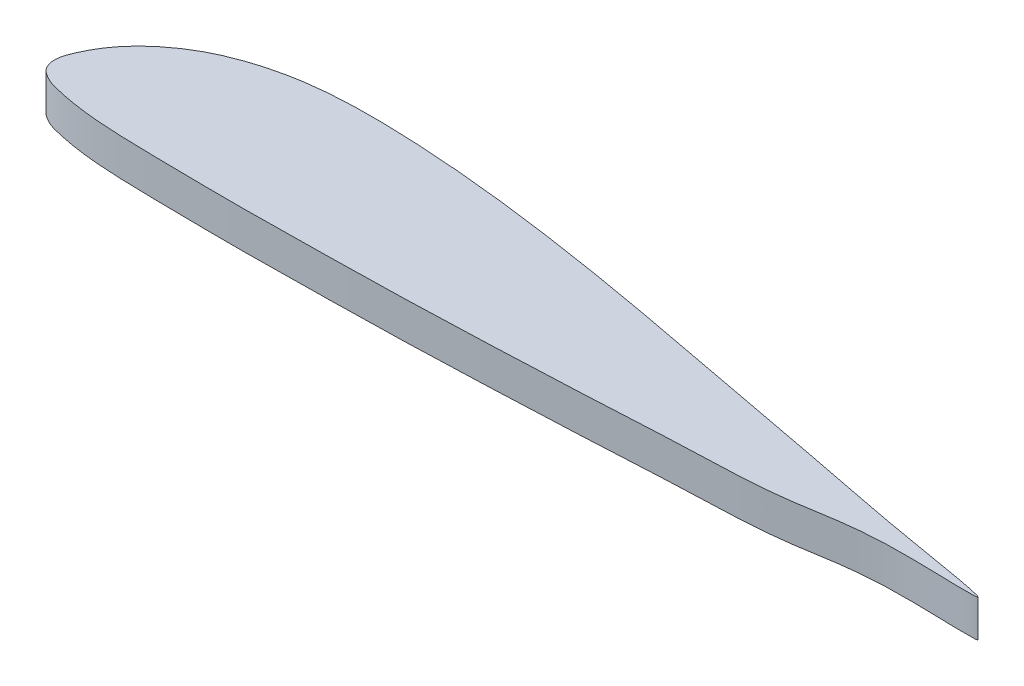
ISO-10303-21;
HEADER;
FILE_DESCRIPTION(('STEP AP214'),'2;1');
FILE_NAME('part.step','',(''),(''),'','','');
FILE_SCHEMA(('AUTOMOTIVE_DESIGN { 1 0 10303 214 1 1 1 1 }'));
ENDSEC;
DATA;
#1=APPLICATION_CONTEXT('core data for automotive mechanical design processes');
#2=APPLICATION_PROTOCOL_DEFINITION('international standard','automotive_design',2000,#1);
#3=PRODUCT_CONTEXT('',#1,'mechanical');
#4=PRODUCT('Part','Part','',(#3));
#5=PRODUCT_RELATED_PRODUCT_CATEGORY('part','',(#4));
#6=PRODUCT_DEFINITION_FORMATION('','',#4);
#7=PRODUCT_DEFINITION_CONTEXT('part definition',#1,'design');
#8=PRODUCT_DEFINITION('design','',#6,#7);
#9=PRODUCT_DEFINITION_SHAPE('','',#8);
#10=(LENGTH_UNIT() NAMED_UNIT(*) SI_UNIT(.MILLI.,.METRE.));
#11=(NAMED_UNIT(*) PLANE_ANGLE_UNIT() SI_UNIT($,.RADIAN.));
#12=(NAMED_UNIT(*) SI_UNIT($,.STERADIAN.) SOLID_ANGLE_UNIT());
#13=UNCERTAINTY_MEASURE_WITH_UNIT(LENGTH_MEASURE(1.E-05),#10,'distance_accuracy_value','');
#14=(GEOMETRIC_REPRESENTATION_CONTEXT(3) GLOBAL_UNCERTAINTY_ASSIGNED_CONTEXT((#13)) GLOBAL_UNIT_ASSIGNED_CONTEXT((#10,
#11,#12)) REPRESENTATION_CONTEXT('',''));
#15=CARTESIAN_POINT('',(0.,0.,0.));
#16=DIRECTION('',(0.,0.,1.));
#17=DIRECTION('',(1.,0.,0.));
#18=AXIS2_PLACEMENT_3D('',#15,#16,#17);
#19=CARTESIAN_POINT('',(100.,4.,0.));
#20=CARTESIAN_POINT('',(100.062832480907,4.,-0.251035490916848));
#21=CARTESIAN_POINT('',(88.4237829738261,4.,-2.0771715448077));
#22=CARTESIAN_POINT('',(80.4225108702479,4.,-3.75334635679778));
#23=CARTESIAN_POINT('',(69.8861735451824,4.,-5.70944302800117));
#24=CARTESIAN_POINT('',(60.0386647343152,4.,-7.60775001107157));
#25=CARTESIAN_POINT('',(50.0167380307963,4.,-9.4487948912524));
#26=CARTESIAN_POINT('',(40.0326469934087,4.,-10.9740248038323));
#27=CARTESIAN_POINT('',(31.6814423764122,4.,-11.8576172335413));
#28=CARTESIAN_POINT('',(25.0037329246573,4.,-12.2188022333978));
#29=CARTESIAN_POINT('',(19.9912873424954,4.,-12.2559016705021));
#30=CARTESIAN_POINT('',(14.9320267444677,4.,-11.8315252621144));
#31=CARTESIAN_POINT('',(10.5526989070335,4.,-10.71719481114));
#32=CARTESIAN_POINT('',(7.22601465795583,4.,-9.26426829298485));
#33=CARTESIAN_POINT('',(4.89414281103323,4.,-7.74090036610056));
#34=CARTESIAN_POINT('',(3.22731717546887,4.,-6.30206869587759));
#35=CARTESIAN_POINT('',(1.90757730482551,4.,-4.78457492361257));
#36=CARTESIAN_POINT('',(1.09051334858228,4.,-3.51760297719199));
#37=CARTESIAN_POINT('',(0.311104340416445,4.,-1.94974356982834));
#38=CARTESIAN_POINT('',(-0.274693212782225,4.,-0.387957211097651));
#39=CARTESIAN_POINT('',(0.32241480183204,4.,0.985991259469998));
#40=CARTESIAN_POINT('',(1.12808598583183,4.,1.55327589883329));
#41=CARTESIAN_POINT('',(1.96074307258525,4.,1.98040220262235));
#42=CARTESIAN_POINT('',(3.32507579893781,4.,2.31439891849714));
#43=CARTESIAN_POINT('',(4.98847485858098,4.,2.6515194414197));
#44=CARTESIAN_POINT('',(7.32589348227786,4.,2.96082977289899));
#45=CARTESIAN_POINT('',(10.6627022753876,4.,3.18329815717093));
#46=CARTESIAN_POINT('',(14.9997431695759,4.,3.25230992258939));
#47=CARTESIAN_POINT('',(19.9997023833687,4.,3.31799073600512));
#48=CARTESIAN_POINT('',(25.0003041833152,4.,3.33571491492282));
#49=CARTESIAN_POINT('',(31.6666118269952,4.,3.23361568674636));
#50=CARTESIAN_POINT('',(40.0045418118961,4.,3.11880279253148));
#51=CARTESIAN_POINT('',(49.9937027305764,4.,2.74791710747211));
#52=CARTESIAN_POINT('',(60.032071472342,4.,2.32907933399613));
#53=CARTESIAN_POINT('',(69.8872598450056,4.,1.73529353143155));
#54=CARTESIAN_POINT('',(80.4501817556825,4.,1.52889578989182));
#55=CARTESIAN_POINT('',(88.4174601450651,4.,-0.540970313366487));
#56=CARTESIAN_POINT('',(99.9382718343949,4.,0.246623404524663));
#57=CARTESIAN_POINT('',(100.,4.,0.));
#58=B_SPLINE_CURVE_WITH_KNOTS('',3,(#19,#20,#21,#22,#23,#24,#25,#26,#27,#28,#29,#30,#31,#32,#33,
#34,#35,#36,#37,#38,#39,#40,#41,#42,#43,#44,#45,#46,#47,#48,#49,#50,#51,#52,#53,#54,#55,#56,
#57),.UNSPECIFIED.,.T.,.F.,(4,1,1,1,1,1,1,1,1,1,1,1,1,1,1,1,1,1,1,1,1,1,1,1,1,1,1,1,1,1,1,1,1,1,
1,1,4),(0.,0.0490408656764944,0.0980817313529888,0.147122597029483,0.196163462705978,
0.245116685545263,0.293834629256661,0.342263553193416,0.366385572960314,0.390475045746911,
0.414675268241992,0.439565651155836,0.455415352681607,0.466907823883372,0.479711554297043,
0.48709032929319,0.495936907344408,0.501323477213704,0.512663454203477,0.518310059511212,
0.521365151754157,0.526751721623454,0.531754914327112,0.541581529671993,0.551304728452871,
0.565797224363326,0.589894838016151,0.613986045182352,0.638075566147846,0.662166773314048,
0.710353523244322,0.758560308204797,0.806785868446715,0.85502500010905,0.903284914630982,
0.951821054426205,1.),.UNSPECIFIED.);
#59=DIRECTION('',(0.,-1.,0.));
#60=VECTOR('',#59,1.);
#61=SURFACE_OF_LINEAR_EXTRUSION('',#58,#60);
#62=CARTESIAN_POINT('',(100.,4.,0.));
#63=VERTEX_POINT('',#62);
#64=EDGE_CURVE('E10',#63,#63,#58,.T.);
#65=ORIENTED_EDGE('',*,*,#64,.F.);
#66=EDGE_LOOP('',(#65));
#67=FACE_BOUND('',#66,.T.);
#68=CARTESIAN_POINT('',(100.,0.,0.));
#69=CARTESIAN_POINT('',(100.062832480907,0.,-0.251035490916848));
#70=CARTESIAN_POINT('',(88.4237829738261,0.,-2.0771715448077));
#71=CARTESIAN_POINT('',(80.4225108702479,0.,-3.75334635679778));
#72=CARTESIAN_POINT('',(69.8861735451824,0.,-5.70944302800117));
#73=CARTESIAN_POINT('',(60.0386647343152,0.,-7.60775001107157));
#74=CARTESIAN_POINT('',(50.0167380307963,0.,-9.4487948912524));
#75=CARTESIAN_POINT('',(40.0326469934087,0.,-10.9740248038323));
#76=CARTESIAN_POINT('',(31.6814423764122,0.,-11.8576172335413));
#77=CARTESIAN_POINT('',(25.0037329246573,0.,-12.2188022333978));
#78=CARTESIAN_POINT('',(19.9912873424954,0.,-12.2559016705021));
#79=CARTESIAN_POINT('',(14.9320267444677,0.,-11.8315252621144));
#80=CARTESIAN_POINT('',(10.5526989070335,0.,-10.71719481114));
#81=CARTESIAN_POINT('',(7.22601465795583,0.,-9.26426829298485));
#82=CARTESIAN_POINT('',(4.89414281103323,0.,-7.74090036610056));
#83=CARTESIAN_POINT('',(3.22731717546887,0.,-6.30206869587759));
#84=CARTESIAN_POINT('',(1.90757730482551,0.,-4.78457492361257));
#85=CARTESIAN_POINT('',(1.09051334858228,0.,-3.51760297719199));
#86=CARTESIAN_POINT('',(0.311104340416445,0.,-1.94974356982834));
#87=CARTESIAN_POINT('',(-0.274693212782225,0.,-0.387957211097651));
#88=CARTESIAN_POINT('',(0.32241480183204,0.,0.985991259469998));
#89=CARTESIAN_POINT('',(1.12808598583183,0.,1.55327589883329));
#90=CARTESIAN_POINT('',(1.96074307258525,0.,1.98040220262235));
#91=CARTESIAN_POINT('',(3.32507579893781,0.,2.31439891849714));
#92=CARTESIAN_POINT('',(4.98847485858098,0.,2.6515194414197));
#93=CARTESIAN_POINT('',(7.32589348227786,0.,2.96082977289899));
#94=CARTESIAN_POINT('',(10.6627022753876,0.,3.18329815717093));
#95=CARTESIAN_POINT('',(14.9997431695759,0.,3.25230992258939));
#96=CARTESIAN_POINT('',(19.9997023833687,0.,3.31799073600512));
#97=CARTESIAN_POINT('',(25.0003041833152,0.,3.33571491492282));
#98=CARTESIAN_POINT('',(31.6666118269952,0.,3.23361568674636));
#99=CARTESIAN_POINT('',(40.0045418118961,0.,3.11880279253148));
#100=CARTESIAN_POINT('',(49.9937027305764,0.,2.74791710747211));
#101=CARTESIAN_POINT('',(60.032071472342,0.,2.32907933399613));
#102=CARTESIAN_POINT('',(69.8872598450056,0.,1.73529353143155));
#103=CARTESIAN_POINT('',(80.4501817556825,0.,1.52889578989182));
#104=CARTESIAN_POINT('',(88.4174601450651,0.,-0.540970313366487));
#105=CARTESIAN_POINT('',(99.9382718343949,0.,0.246623404524663));
#106=CARTESIAN_POINT('',(100.,0.,0.));
#107=B_SPLINE_CURVE_WITH_KNOTS('',3,(#68,#69,#70,#71,#72,#73,#74,#75,#76,#77,#78,#79,#80,#81,
#82,#83,#84,#85,#86,#87,#88,#89,#90,#91,#92,#93,#94,#95,#96,#97,#98,#99,#100,#101,#102,#103,
#104,#105,#106),.UNSPECIFIED.,.T.,.F.,(4,1,1,1,1,1,1,1,1,1,1,1,1,1,1,1,1,1,1,1,1,1,1,1,1,1,1,1,
1,1,1,1,1,1,1,1,4),(0.,0.0490408656764944,0.0980817313529888,0.147122597029483,
0.196163462705978,0.245116685545263,0.293834629256661,0.342263553193416,0.366385572960314,
0.390475045746911,0.414675268241992,0.439565651155836,0.455415352681607,0.466907823883372,
0.479711554297043,0.48709032929319,0.495936907344408,0.501323477213704,0.512663454203477,
0.518310059511212,0.521365151754157,0.526751721623454,0.531754914327112,0.541581529671993,
0.551304728452871,0.565797224363326,0.589894838016151,0.613986045182352,0.638075566147846,
0.662166773314048,0.710353523244322,0.758560308204797,0.806785868446715,0.85502500010905,
0.903284914630982,0.951821054426205,1.),.UNSPECIFIED.);
#108=CARTESIAN_POINT('',(100.,0.,0.));
#109=VERTEX_POINT('',#108);
#110=EDGE_CURVE('E33',#109,#109,#107,.T.);
#111=ORIENTED_EDGE('',*,*,#110,.T.);
#112=EDGE_LOOP('',(#111));
#113=FACE_BOUND('',#112,.T.);
#114=ADVANCED_FACE('F29',(#67,#113),#61,.F.);
#115=CARTESIAN_POINT('',(0.616978549914251,4.,-2.55175560258792));
#116=DIRECTION('',(0.,-1.,0.));
#117=DIRECTION('',(0.,0.,-1.));
#118=AXIS2_PLACEMENT_3D('',#115,#116,#117);
#119=PLANE('',#118);
#120=ORIENTED_EDGE('',*,*,#64,.T.);
#121=EDGE_LOOP('',(#120));
#122=FACE_BOUND('',#121,.T.);
#123=ADVANCED_FACE('F52',(#122),#119,.F.);
#124=CARTESIAN_POINT('',(0.616978549914251,0.,-2.55175560258792));
#125=DIRECTION('',(0.,-1.,0.));
#126=DIRECTION('',(0.,0.,-1.));
#127=AXIS2_PLACEMENT_3D('',#124,#125,#126);
#128=PLANE('',#127);
#129=ORIENTED_EDGE('',*,*,#110,.F.);
#130=EDGE_LOOP('',(#129));
#131=FACE_BOUND('',#130,.T.);
#132=ADVANCED_FACE('F50',(#131),#128,.T.);
#133=CLOSED_SHELL('',(#114,#123,#132));
#134=MANIFOLD_SOLID_BREP('B2',#133);
#135=ADVANCED_BREP_SHAPE_REPRESENTATION('',(#18,#134),#14);
#136=SHAPE_DEFINITION_REPRESENTATION(#9,#135);
ENDSEC;
END-ISO-10303-21;
